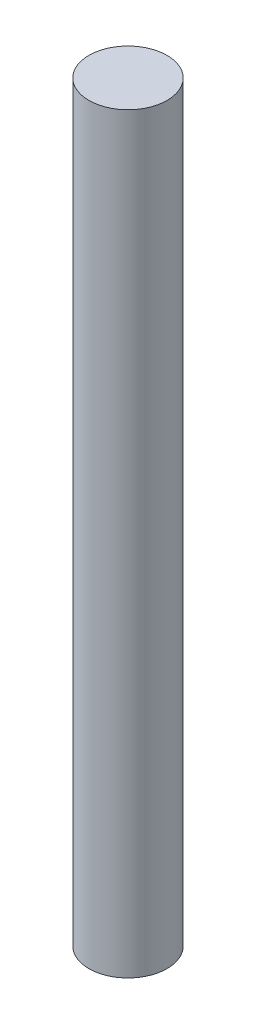
ISO-10303-21;
HEADER;
FILE_DESCRIPTION(('STEP AP214'),'2;1');
FILE_NAME('part.step','',(''),(''),'','','');
FILE_SCHEMA(('AUTOMOTIVE_DESIGN { 1 0 10303 214 1 1 1 1 }'));
ENDSEC;
DATA;
#1=APPLICATION_CONTEXT('core data for automotive mechanical design processes');
#2=APPLICATION_PROTOCOL_DEFINITION('international standard','automotive_design',2000,#1);
#3=PRODUCT_CONTEXT('',#1,'mechanical');
#4=PRODUCT('Part','Part','',(#3));
#5=PRODUCT_RELATED_PRODUCT_CATEGORY('part','',(#4));
#6=PRODUCT_DEFINITION_FORMATION('','',#4);
#7=PRODUCT_DEFINITION_CONTEXT('part definition',#1,'design');
#8=PRODUCT_DEFINITION('design','',#6,#7);
#9=PRODUCT_DEFINITION_SHAPE('','',#8);
#10=(LENGTH_UNIT() NAMED_UNIT(*) SI_UNIT(.MILLI.,.METRE.));
#11=(NAMED_UNIT(*) PLANE_ANGLE_UNIT() SI_UNIT($,.RADIAN.));
#12=(NAMED_UNIT(*) SI_UNIT($,.STERADIAN.) SOLID_ANGLE_UNIT());
#13=UNCERTAINTY_MEASURE_WITH_UNIT(LENGTH_MEASURE(1.E-05),#10,'distance_accuracy_value','');
#14=(GEOMETRIC_REPRESENTATION_CONTEXT(3) GLOBAL_UNCERTAINTY_ASSIGNED_CONTEXT((#13)) GLOBAL_UNIT_ASSIGNED_CONTEXT((#10,
#11,#12)) REPRESENTATION_CONTEXT('',''));
#15=CARTESIAN_POINT('',(0.,0.,0.));
#16=DIRECTION('',(0.,0.,1.));
#17=DIRECTION('',(1.,0.,0.));
#18=AXIS2_PLACEMENT_3D('',#15,#16,#17);
#19=CARTESIAN_POINT('',(0.,77.,0.));
#20=DIRECTION('',(0.,-1.,0.));
#21=DIRECTION('',(0.,0.,-1.));
#22=AXIS2_PLACEMENT_3D('',#19,#20,#21);
#23=CYLINDRICAL_SURFACE('',#22,4.);
#24=CARTESIAN_POINT('',(0.,77.,0.));
#25=DIRECTION('',(0.,1.,0.));
#26=DIRECTION('',(0.,0.,1.));
#27=AXIS2_PLACEMENT_3D('',#24,#25,#26);
#28=CIRCLE('',#27,4.);
#29=CARTESIAN_POINT('',(0.,77.,4.));
#30=VERTEX_POINT('',#29);
#31=EDGE_CURVE('E10',#30,#30,#28,.T.);
#32=ORIENTED_EDGE('',*,*,#31,.F.);
#33=EDGE_LOOP('',(#32));
#34=FACE_BOUND('',#33,.T.);
#35=CARTESIAN_POINT('',(0.,0.,0.));
#36=DIRECTION('',(0.,1.,0.));
#37=DIRECTION('',(0.,0.,1.));
#38=AXIS2_PLACEMENT_3D('',#35,#36,#37);
#39=CIRCLE('',#38,4.);
#40=CARTESIAN_POINT('',(0.,0.,4.));
#41=VERTEX_POINT('',#40);
#42=EDGE_CURVE('E40',#41,#41,#39,.T.);
#43=ORIENTED_EDGE('',*,*,#42,.T.);
#44=EDGE_LOOP('',(#43));
#45=FACE_BOUND('',#44,.T.);
#46=ADVANCED_FACE('F37',(#34,#45),#23,.T.);
#47=CARTESIAN_POINT('',(0.,77.,0.));
#48=DIRECTION('',(0.,1.,0.));
#49=DIRECTION('',(0.,0.,1.));
#50=AXIS2_PLACEMENT_3D('',#47,#48,#49);
#51=PLANE('',#50);
#52=ORIENTED_EDGE('',*,*,#31,.T.);
#53=EDGE_LOOP('',(#52));
#54=FACE_BOUND('',#53,.T.);
#55=ADVANCED_FACE('F52',(#54),#51,.T.);
#56=CARTESIAN_POINT('',(0.,0.,0.));
#57=DIRECTION('',(0.,1.,0.));
#58=DIRECTION('',(0.,0.,1.));
#59=AXIS2_PLACEMENT_3D('',#56,#57,#58);
#60=PLANE('',#59);
#61=ORIENTED_EDGE('',*,*,#42,.F.);
#62=EDGE_LOOP('',(#61));
#63=FACE_BOUND('',#62,.T.);
#64=ADVANCED_FACE('F50',(#63),#60,.F.);
#65=CLOSED_SHELL('',(#46,#55,#64));
#66=MANIFOLD_SOLID_BREP('B2',#65);
#67=ADVANCED_BREP_SHAPE_REPRESENTATION('',(#18,#66),#14);
#68=SHAPE_DEFINITION_REPRESENTATION(#9,#67);
ENDSEC;
END-ISO-10303-21;
